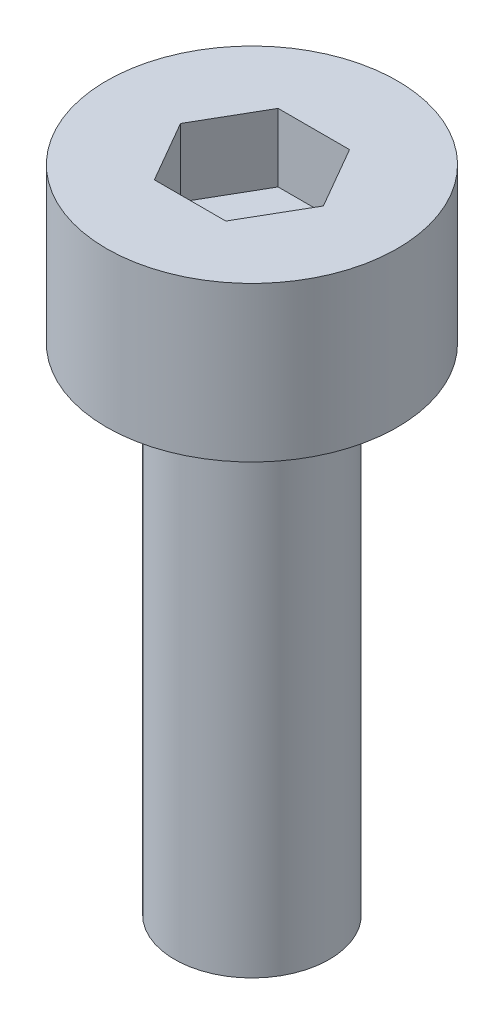
ISO-10303-21;
HEADER;
FILE_DESCRIPTION(('STEP AP214'),'2;1');
FILE_NAME('part.step','',(''),(''),'','','');
FILE_SCHEMA(('AUTOMOTIVE_DESIGN { 1 0 10303 214 1 1 1 1 }'));
ENDSEC;
DATA;
#1=APPLICATION_CONTEXT('core data for automotive mechanical design processes');
#2=APPLICATION_PROTOCOL_DEFINITION('international standard','automotive_design',2000,#1);
#3=PRODUCT_CONTEXT('',#1,'mechanical');
#4=PRODUCT('Part','Part','',(#3));
#5=PRODUCT_RELATED_PRODUCT_CATEGORY('part','',(#4));
#6=PRODUCT_DEFINITION_FORMATION('','',#4);
#7=PRODUCT_DEFINITION_CONTEXT('part definition',#1,'design');
#8=PRODUCT_DEFINITION('design','',#6,#7);
#9=PRODUCT_DEFINITION_SHAPE('','',#8);
#10=(LENGTH_UNIT() NAMED_UNIT(*) SI_UNIT(.MILLI.,.METRE.));
#11=(NAMED_UNIT(*) PLANE_ANGLE_UNIT() SI_UNIT($,.RADIAN.));
#12=(NAMED_UNIT(*) SI_UNIT($,.STERADIAN.) SOLID_ANGLE_UNIT());
#13=UNCERTAINTY_MEASURE_WITH_UNIT(LENGTH_MEASURE(1.E-05),#10,'distance_accuracy_value','');
#14=(GEOMETRIC_REPRESENTATION_CONTEXT(3) GLOBAL_UNCERTAINTY_ASSIGNED_CONTEXT((#13)) GLOBAL_UNIT_ASSIGNED_CONTEXT((#10,
#11,#12)) REPRESENTATION_CONTEXT('',''));
#15=CARTESIAN_POINT('',(0.,0.,0.));
#16=DIRECTION('',(0.,0.,1.));
#17=DIRECTION('',(1.,0.,0.));
#18=AXIS2_PLACEMENT_3D('',#15,#16,#17);
#19=CARTESIAN_POINT('',(0.,2.5,0.));
#20=DIRECTION('',(0.,-1.,0.));
#21=DIRECTION('',(0.,0.,-1.));
#22=AXIS2_PLACEMENT_3D('',#19,#20,#21);
#23=CYLINDRICAL_SURFACE('',#22,2.35);
#24=CARTESIAN_POINT('',(0.,2.5,0.));
#25=DIRECTION('',(0.,1.,0.));
#26=DIRECTION('',(0.,0.,1.));
#27=AXIS2_PLACEMENT_3D('',#24,#25,#26);
#28=CIRCLE('',#27,2.35);
#29=CARTESIAN_POINT('',(0.,2.5,2.35));
#30=VERTEX_POINT('',#29);
#31=EDGE_CURVE('E44',#30,#30,#28,.T.);
#32=ORIENTED_EDGE('',*,*,#31,.F.);
#33=EDGE_LOOP('',(#32));
#34=FACE_BOUND('',#33,.T.);
#35=CARTESIAN_POINT('',(0.,0.,0.));
#36=DIRECTION('',(0.,1.,0.));
#37=DIRECTION('',(0.,0.,1.));
#38=AXIS2_PLACEMENT_3D('',#35,#36,#37);
#39=CIRCLE('',#38,2.35);
#40=CARTESIAN_POINT('',(0.,0.,2.35));
#41=VERTEX_POINT('',#40);
#42=EDGE_CURVE('E39',#41,#41,#39,.T.);
#43=ORIENTED_EDGE('',*,*,#42,.T.);
#44=EDGE_LOOP('',(#43));
#45=FACE_BOUND('',#44,.T.);
#46=ADVANCED_FACE('F36',(#34,#45),#23,.T.);
#47=CARTESIAN_POINT('',(0.,2.5,0.));
#48=DIRECTION('',(0.,1.,0.));
#49=DIRECTION('',(0.,0.,1.));
#50=AXIS2_PLACEMENT_3D('',#47,#48,#49);
#51=PLANE('',#50);
#52=DIRECTION('',(0.5,0.,-0.866025403784439));
#53=VECTOR('',#52,1.);
#54=CARTESIAN_POINT('',(0.577350269189626,2.5,1.));
#55=LINE('',#54,#53);
#56=CARTESIAN_POINT('',(0.577350269189626,2.5,1.));
#57=VERTEX_POINT('',#56);
#58=CARTESIAN_POINT('',(1.15470053837925,2.5,0.));
#59=VERTEX_POINT('',#58);
#60=EDGE_CURVE('E52',#57,#59,#55,.T.);
#61=ORIENTED_EDGE('',*,*,#60,.F.);
#62=DIRECTION('',(1.,0.,0.));
#63=VECTOR('',#62,1.);
#64=CARTESIAN_POINT('',(-0.577350269189627,2.5,1.));
#65=LINE('',#64,#63);
#66=CARTESIAN_POINT('',(-0.577350269189627,2.5,1.));
#67=VERTEX_POINT('',#66);
#68=EDGE_CURVE('E136',#67,#57,#65,.T.);
#69=ORIENTED_EDGE('',*,*,#68,.F.);
#70=DIRECTION('',(0.5,0.,0.866025403784439));
#71=VECTOR('',#70,1.);
#72=CARTESIAN_POINT('',(-1.15470053837925,2.5,0.));
#73=LINE('',#72,#71);
#74=CARTESIAN_POINT('',(-1.15470053837925,2.5,0.));
#75=VERTEX_POINT('',#74);
#76=EDGE_CURVE('E134',#75,#67,#73,.T.);
#77=ORIENTED_EDGE('',*,*,#76,.F.);
#78=DIRECTION('',(-0.5,0.,0.866025403784438));
#79=VECTOR('',#78,1.);
#80=CARTESIAN_POINT('',(-0.577350269189626,2.5,-1.));
#81=LINE('',#80,#79);
#82=CARTESIAN_POINT('',(-0.577350269189626,2.5,-1.));
#83=VERTEX_POINT('',#82);
#84=EDGE_CURVE('E100',#83,#75,#81,.T.);
#85=ORIENTED_EDGE('',*,*,#84,.F.);
#86=DIRECTION('',(-1.,0.,0.));
#87=VECTOR('',#86,1.);
#88=CARTESIAN_POINT('',(0.577350269189626,2.5,-1.));
#89=LINE('',#88,#87);
#90=CARTESIAN_POINT('',(0.577350269189626,2.5,-1.));
#91=VERTEX_POINT('',#90);
#92=EDGE_CURVE('E130',#91,#83,#89,.T.);
#93=ORIENTED_EDGE('',*,*,#92,.F.);
#94=DIRECTION('',(-0.5,0.,-0.866025403784439));
#95=VECTOR('',#94,1.);
#96=CARTESIAN_POINT('',(1.15470053837925,2.5,0.));
#97=LINE('',#96,#95);
#98=EDGE_CURVE('E126',#59,#91,#97,.T.);
#99=ORIENTED_EDGE('',*,*,#98,.F.);
#100=EDGE_LOOP('',(#61,#69,#77,#85,#93,#99));
#101=FACE_BOUND('',#100,.T.);
#102=ORIENTED_EDGE('',*,*,#31,.T.);
#103=EDGE_LOOP('',(#102));
#104=FACE_BOUND('',#103,.T.);
#105=ADVANCED_FACE('F154',(#101,#104),#51,.T.);
#106=CARTESIAN_POINT('',(0.,0.,0.));
#107=DIRECTION('',(0.,1.,0.));
#108=DIRECTION('',(0.,0.,1.));
#109=AXIS2_PLACEMENT_3D('',#106,#107,#108);
#110=PLANE('',#109);
#111=CARTESIAN_POINT('',(0.,0.,0.));
#112=DIRECTION('',(0.,-1.,0.));
#113=DIRECTION('',(0.,0.,-1.));
#114=AXIS2_PLACEMENT_3D('',#111,#112,#113);
#115=CIRCLE('',#114,1.25);
#116=CARTESIAN_POINT('',(0.,0.,-1.25));
#117=VERTEX_POINT('',#116);
#118=EDGE_CURVE('E11',#117,#117,#115,.T.);
#119=ORIENTED_EDGE('',*,*,#118,.F.);
#120=EDGE_LOOP('',(#119));
#121=FACE_BOUND('',#120,.T.);
#122=ORIENTED_EDGE('',*,*,#42,.F.);
#123=EDGE_LOOP('',(#122));
#124=FACE_BOUND('',#123,.T.);
#125=ADVANCED_FACE('F151',(#121,#124),#110,.F.);
#126=CARTESIAN_POINT('',(0.577350269189626,1.4,1.));
#127=DIRECTION('',(0.866025403784439,0.,0.5));
#128=DIRECTION('',(0.5,0.,-0.866025403784439));
#129=AXIS2_PLACEMENT_3D('',#126,#127,#128);
#130=PLANE('',#129);
#131=ORIENTED_EDGE('',*,*,#60,.T.);
#132=DIRECTION('',(0.,1.,0.));
#133=VECTOR('',#132,1.);
#134=CARTESIAN_POINT('',(1.15470053837925,1.4,0.));
#135=LINE('',#134,#133);
#136=CARTESIAN_POINT('',(1.15470053837925,1.4,0.));
#137=VERTEX_POINT('',#136);
#138=EDGE_CURVE('E82',#137,#59,#135,.T.);
#139=ORIENTED_EDGE('',*,*,#138,.F.);
#140=DIRECTION('',(0.5,0.,-0.866025403784439));
#141=VECTOR('',#140,1.);
#142=CARTESIAN_POINT('',(0.577350269189626,1.4,1.));
#143=LINE('',#142,#141);
#144=CARTESIAN_POINT('',(0.577350269189626,1.4,1.));
#145=VERTEX_POINT('',#144);
#146=EDGE_CURVE('E138',#145,#137,#143,.T.);
#147=ORIENTED_EDGE('',*,*,#146,.F.);
#148=DIRECTION('',(0.,1.,0.));
#149=VECTOR('',#148,1.);
#150=CARTESIAN_POINT('',(0.577350269189626,1.4,1.));
#151=LINE('',#150,#149);
#152=EDGE_CURVE('E60',#145,#57,#151,.T.);
#153=ORIENTED_EDGE('',*,*,#152,.T.);
#154=EDGE_LOOP('',(#131,#139,#147,#153));
#155=FACE_BOUND('',#154,.T.);
#156=ADVANCED_FACE('F153',(#155),#130,.F.);
#157=CARTESIAN_POINT('',(-0.577350269189627,1.4,1.));
#158=DIRECTION('',(0.,0.,1.));
#159=DIRECTION('',(1.,0.,0.));
#160=AXIS2_PLACEMENT_3D('',#157,#158,#159);
#161=PLANE('',#160);
#162=ORIENTED_EDGE('',*,*,#68,.T.);
#163=ORIENTED_EDGE('',*,*,#152,.F.);
#164=DIRECTION('',(1.,0.,0.));
#165=VECTOR('',#164,1.);
#166=CARTESIAN_POINT('',(-0.577350269189627,1.4,1.));
#167=LINE('',#166,#165);
#168=CARTESIAN_POINT('',(-0.577350269189627,1.4,1.));
#169=VERTEX_POINT('',#168);
#170=EDGE_CURVE('E112',#169,#145,#167,.T.);
#171=ORIENTED_EDGE('',*,*,#170,.F.);
#172=DIRECTION('',(0.,1.,0.));
#173=VECTOR('',#172,1.);
#174=CARTESIAN_POINT('',(-0.577350269189627,1.4,1.));
#175=LINE('',#174,#173);
#176=EDGE_CURVE('E104',#169,#67,#175,.T.);
#177=ORIENTED_EDGE('',*,*,#176,.T.);
#178=EDGE_LOOP('',(#162,#163,#171,#177));
#179=FACE_BOUND('',#178,.T.);
#180=ADVANCED_FACE('F160',(#179),#161,.F.);
#181=CARTESIAN_POINT('',(-1.15470053837925,1.4,0.));
#182=DIRECTION('',(-0.866025403784439,0.,0.5));
#183=DIRECTION('',(0.5,0.,0.866025403784439));
#184=AXIS2_PLACEMENT_3D('',#181,#182,#183);
#185=PLANE('',#184);
#186=ORIENTED_EDGE('',*,*,#76,.T.);
#187=ORIENTED_EDGE('',*,*,#176,.F.);
#188=DIRECTION('',(0.5,0.,0.866025403784439));
#189=VECTOR('',#188,1.);
#190=CARTESIAN_POINT('',(-1.15470053837925,1.4,0.));
#191=LINE('',#190,#189);
#192=CARTESIAN_POINT('',(-1.15470053837925,1.4,0.));
#193=VERTEX_POINT('',#192);
#194=EDGE_CURVE('E108',#193,#169,#191,.T.);
#195=ORIENTED_EDGE('',*,*,#194,.F.);
#196=DIRECTION('',(0.,1.,0.));
#197=VECTOR('',#196,1.);
#198=CARTESIAN_POINT('',(-1.15470053837925,1.4,0.));
#199=LINE('',#198,#197);
#200=EDGE_CURVE('E93',#193,#75,#199,.T.);
#201=ORIENTED_EDGE('',*,*,#200,.T.);
#202=EDGE_LOOP('',(#186,#187,#195,#201));
#203=FACE_BOUND('',#202,.T.);
#204=ADVANCED_FACE('F109',(#203),#185,.F.);
#205=CARTESIAN_POINT('',(-0.577350269189626,1.4,-1.));
#206=DIRECTION('',(-0.866025403784439,0.,-0.5));
#207=DIRECTION('',(-0.5,0.,0.866025403784438));
#208=AXIS2_PLACEMENT_3D('',#205,#206,#207);
#209=PLANE('',#208);
#210=ORIENTED_EDGE('',*,*,#84,.T.);
#211=ORIENTED_EDGE('',*,*,#200,.F.);
#212=DIRECTION('',(-0.5,0.,0.866025403784438));
#213=VECTOR('',#212,1.);
#214=CARTESIAN_POINT('',(-0.577350269189626,1.4,-1.));
#215=LINE('',#214,#213);
#216=CARTESIAN_POINT('',(-0.577350269189626,1.4,-1.));
#217=VERTEX_POINT('',#216);
#218=EDGE_CURVE('E97',#217,#193,#215,.T.);
#219=ORIENTED_EDGE('',*,*,#218,.F.);
#220=DIRECTION('',(0.,1.,0.));
#221=VECTOR('',#220,1.);
#222=CARTESIAN_POINT('',(-0.577350269189626,1.4,-1.));
#223=LINE('',#222,#221);
#224=EDGE_CURVE('E105',#217,#83,#223,.T.);
#225=ORIENTED_EDGE('',*,*,#224,.T.);
#226=EDGE_LOOP('',(#210,#211,#219,#225));
#227=FACE_BOUND('',#226,.T.);
#228=ADVANCED_FACE('F95',(#227),#209,.F.);
#229=CARTESIAN_POINT('',(0.577350269189626,1.4,-1.));
#230=DIRECTION('',(0.,0.,-1.));
#231=DIRECTION('',(-1.,0.,0.));
#232=AXIS2_PLACEMENT_3D('',#229,#230,#231);
#233=PLANE('',#232);
#234=ORIENTED_EDGE('',*,*,#92,.T.);
#235=ORIENTED_EDGE('',*,*,#224,.F.);
#236=DIRECTION('',(-1.,0.,0.));
#237=VECTOR('',#236,1.);
#238=CARTESIAN_POINT('',(0.577350269189626,1.4,-1.));
#239=LINE('',#238,#237);
#240=CARTESIAN_POINT('',(0.577350269189626,1.4,-1.));
#241=VERTEX_POINT('',#240);
#242=EDGE_CURVE('E118',#241,#217,#239,.T.);
#243=ORIENTED_EDGE('',*,*,#242,.F.);
#244=DIRECTION('',(0.,1.,0.));
#245=VECTOR('',#244,1.);
#246=CARTESIAN_POINT('',(0.577350269189626,1.4,-1.));
#247=LINE('',#246,#245);
#248=EDGE_CURVE('E142',#241,#91,#247,.T.);
#249=ORIENTED_EDGE('',*,*,#248,.T.);
#250=EDGE_LOOP('',(#234,#235,#243,#249));
#251=FACE_BOUND('',#250,.T.);
#252=ADVANCED_FACE('F205',(#251),#233,.F.);
#253=CARTESIAN_POINT('',(1.15470053837925,1.4,0.));
#254=DIRECTION('',(0.866025403784439,0.,-0.5));
#255=DIRECTION('',(-0.5,0.,-0.866025403784439));
#256=AXIS2_PLACEMENT_3D('',#253,#254,#255);
#257=PLANE('',#256);
#258=ORIENTED_EDGE('',*,*,#98,.T.);
#259=ORIENTED_EDGE('',*,*,#248,.F.);
#260=DIRECTION('',(-0.5,0.,-0.866025403784439));
#261=VECTOR('',#260,1.);
#262=CARTESIAN_POINT('',(1.15470053837925,1.4,0.));
#263=LINE('',#262,#261);
#264=EDGE_CURVE('E120',#137,#241,#263,.T.);
#265=ORIENTED_EDGE('',*,*,#264,.F.);
#266=ORIENTED_EDGE('',*,*,#138,.T.);
#267=EDGE_LOOP('',(#258,#259,#265,#266));
#268=FACE_BOUND('',#267,.T.);
#269=ADVANCED_FACE('F214',(#268),#257,.F.);
#270=CARTESIAN_POINT('',(0.,1.4,0.));
#271=DIRECTION('',(0.,1.,0.));
#272=DIRECTION('',(0.,0.,1.));
#273=AXIS2_PLACEMENT_3D('',#270,#271,#272);
#274=PLANE('',#273);
#275=ORIENTED_EDGE('',*,*,#146,.T.);
#276=ORIENTED_EDGE('',*,*,#264,.T.);
#277=ORIENTED_EDGE('',*,*,#242,.T.);
#278=ORIENTED_EDGE('',*,*,#218,.T.);
#279=ORIENTED_EDGE('',*,*,#194,.T.);
#280=ORIENTED_EDGE('',*,*,#170,.T.);
#281=EDGE_LOOP('',(#275,#276,#277,#278,#279,#280));
#282=FACE_BOUND('',#281,.T.);
#283=ADVANCED_FACE('F115',(#282),#274,.T.);
#284=CARTESIAN_POINT('',(0.,-8.,0.));
#285=DIRECTION('',(0.,1.,0.));
#286=DIRECTION('',(0.,0.,1.));
#287=AXIS2_PLACEMENT_3D('',#284,#285,#286);
#288=CYLINDRICAL_SURFACE('',#287,1.25);
#289=CARTESIAN_POINT('',(0.,-8.,0.));
#290=DIRECTION('',(0.,-1.,0.));
#291=DIRECTION('',(0.,0.,-1.));
#292=AXIS2_PLACEMENT_3D('',#289,#290,#291);
#293=CIRCLE('',#292,1.25);
#294=CARTESIAN_POINT('',(0.,-8.,-1.25));
#295=VERTEX_POINT('',#294);
#296=EDGE_CURVE('E127',#295,#295,#293,.T.);
#297=ORIENTED_EDGE('',*,*,#296,.F.);
#298=EDGE_LOOP('',(#297));
#299=FACE_BOUND('',#298,.T.);
#300=ORIENTED_EDGE('',*,*,#118,.T.);
#301=EDGE_LOOP('',(#300));
#302=FACE_BOUND('',#301,.T.);
#303=ADVANCED_FACE('F232',(#299,#302),#288,.T.);
#304=CARTESIAN_POINT('',(0.,-8.,0.));
#305=DIRECTION('',(0.,-1.,0.));
#306=DIRECTION('',(0.,0.,-1.));
#307=AXIS2_PLACEMENT_3D('',#304,#305,#306);
#308=PLANE('',#307);
#309=ORIENTED_EDGE('',*,*,#296,.T.);
#310=EDGE_LOOP('',(#309));
#311=FACE_BOUND('',#310,.T.);
#312=ADVANCED_FACE('F246',(#311),#308,.T.);
#313=CLOSED_SHELL('',(#46,#105,#125,#156,#180,#204,#228,#252,#269,#283,#303,#312));
#314=MANIFOLD_SOLID_BREP('B2',#313);
#315=ADVANCED_BREP_SHAPE_REPRESENTATION('',(#18,#314),#14);
#316=SHAPE_DEFINITION_REPRESENTATION(#9,#315);
ENDSEC;
END-ISO-10303-21;
